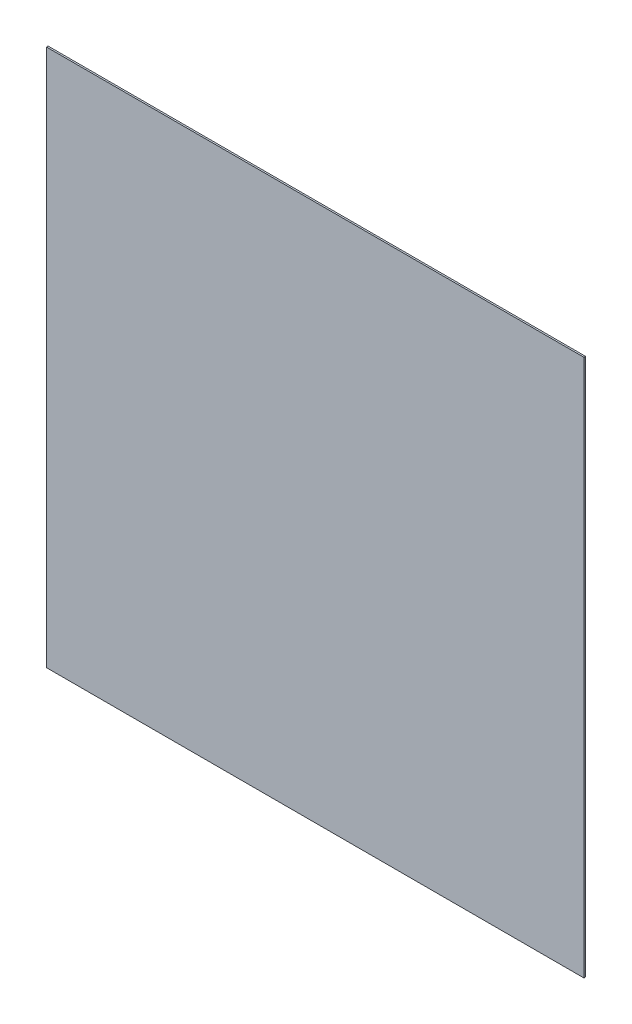
ISO-10303-21;
HEADER;
FILE_DESCRIPTION(('STEP AP214'),'2;1');
FILE_NAME('part.step','',(''),(''),'','','');
FILE_SCHEMA(('AUTOMOTIVE_DESIGN { 1 0 10303 214 1 1 1 1 }'));
ENDSEC;
DATA;
#1=APPLICATION_CONTEXT('core data for automotive mechanical design processes');
#2=APPLICATION_PROTOCOL_DEFINITION('international standard','automotive_design',2000,#1);
#3=PRODUCT_CONTEXT('',#1,'mechanical');
#4=PRODUCT('Part','Part','',(#3));
#5=PRODUCT_RELATED_PRODUCT_CATEGORY('part','',(#4));
#6=PRODUCT_DEFINITION_FORMATION('','',#4);
#7=PRODUCT_DEFINITION_CONTEXT('part definition',#1,'design');
#8=PRODUCT_DEFINITION('design','',#6,#7);
#9=PRODUCT_DEFINITION_SHAPE('','',#8);
#10=(LENGTH_UNIT() NAMED_UNIT(*) SI_UNIT(.MILLI.,.METRE.));
#11=(NAMED_UNIT(*) PLANE_ANGLE_UNIT() SI_UNIT($,.RADIAN.));
#12=(NAMED_UNIT(*) SI_UNIT($,.STERADIAN.) SOLID_ANGLE_UNIT());
#13=UNCERTAINTY_MEASURE_WITH_UNIT(LENGTH_MEASURE(1.E-05),#10,'distance_accuracy_value','');
#14=(GEOMETRIC_REPRESENTATION_CONTEXT(3) GLOBAL_UNCERTAINTY_ASSIGNED_CONTEXT((#13)) GLOBAL_UNIT_ASSIGNED_CONTEXT((#10,
#11,#12)) REPRESENTATION_CONTEXT('',''));
#15=CARTESIAN_POINT('',(0.,0.,0.));
#16=DIRECTION('',(0.,0.,1.));
#17=DIRECTION('',(1.,0.,0.));
#18=AXIS2_PLACEMENT_3D('',#15,#16,#17);
#19=CARTESIAN_POINT('',(0.221931906506307,27.2117550842403,13.76934));
#20=DIRECTION('',(0.,-1.,0.));
#21=DIRECTION('',(0.,0.,-1.));
#22=AXIS2_PLACEMENT_3D('',#19,#20,#21);
#23=PLANE('',#22);
#24=DIRECTION('',(-1.,0.,0.));
#25=VECTOR('',#24,1.);
#26=CARTESIAN_POINT('',(5.17493190650631,27.2117550842403,13.7414));
#27=LINE('',#26,#25);
#28=CARTESIAN_POINT('',(9.30243190650632,27.2117550842403,13.7414));
#29=VERTEX_POINT('',#28);
#30=CARTESIAN_POINT('',(1.04743190650631,27.2117550842403,13.7414));
#31=VERTEX_POINT('',#30);
#32=EDGE_CURVE('E77',#29,#31,#27,.T.);
#33=ORIENTED_EDGE('',*,*,#32,.F.);
#34=DIRECTION('',(0.,0.,-1.));
#35=VECTOR('',#34,1.);
#36=CARTESIAN_POINT('',(9.30243190650632,27.2117550842403,13.7541));
#37=LINE('',#36,#35);
#38=CARTESIAN_POINT('',(9.30243190650632,27.2117550842403,13.7668));
#39=VERTEX_POINT('',#38);
#40=EDGE_CURVE('E69',#39,#29,#37,.T.);
#41=ORIENTED_EDGE('',*,*,#40,.F.);
#42=DIRECTION('',(1.,0.,0.));
#43=VECTOR('',#42,1.);
#44=CARTESIAN_POINT('',(5.17493190650631,27.2117550842403,13.7668));
#45=LINE('',#44,#43);
#46=CARTESIAN_POINT('',(1.04743190650631,27.2117550842403,13.7668));
#47=VERTEX_POINT('',#46);
#48=EDGE_CURVE('E68',#47,#39,#45,.T.);
#49=ORIENTED_EDGE('',*,*,#48,.F.);
#50=DIRECTION('',(0.,0.,-1.));
#51=VECTOR('',#50,1.);
#52=CARTESIAN_POINT('',(1.04743190650631,27.2117550842403,13.7541));
#53=LINE('',#52,#51);
#54=EDGE_CURVE('E34',#47,#31,#53,.T.);
#55=ORIENTED_EDGE('',*,*,#54,.T.);
#56=EDGE_LOOP('',(#33,#41,#49,#55));
#57=FACE_BOUND('',#56,.T.);
#58=ADVANCED_FACE('F17',(#57),#23,.T.);
#59=CARTESIAN_POINT('',(0.221931906506307,35.4667550842403,13.73886));
#60=DIRECTION('',(0.,1.,0.));
#61=DIRECTION('',(0.,0.,1.));
#62=AXIS2_PLACEMENT_3D('',#59,#60,#61);
#63=PLANE('',#62);
#64=DIRECTION('',(1.,0.,0.));
#65=VECTOR('',#64,1.);
#66=CARTESIAN_POINT('',(5.17493190650631,35.4667550842403,13.7414));
#67=LINE('',#66,#65);
#68=CARTESIAN_POINT('',(1.04743190650631,35.4667550842403,13.7414));
#69=VERTEX_POINT('',#68);
#70=CARTESIAN_POINT('',(9.30243190650632,35.4667550842403,13.7414));
#71=VERTEX_POINT('',#70);
#72=EDGE_CURVE('E85',#69,#71,#67,.T.);
#73=ORIENTED_EDGE('',*,*,#72,.F.);
#74=DIRECTION('',(0.,0.,1.));
#75=VECTOR('',#74,1.);
#76=CARTESIAN_POINT('',(1.04743190650631,35.4667550842403,13.7541));
#77=LINE('',#76,#75);
#78=CARTESIAN_POINT('',(1.04743190650631,35.4667550842403,13.7668));
#79=VERTEX_POINT('',#78);
#80=EDGE_CURVE('E74',#69,#79,#77,.T.);
#81=ORIENTED_EDGE('',*,*,#80,.T.);
#82=DIRECTION('',(-1.,0.,0.));
#83=VECTOR('',#82,1.);
#84=CARTESIAN_POINT('',(5.17493190650631,35.4667550842403,13.7668));
#85=LINE('',#84,#83);
#86=CARTESIAN_POINT('',(9.30243190650632,35.4667550842403,13.7668));
#87=VERTEX_POINT('',#86);
#88=EDGE_CURVE('E72',#87,#79,#85,.T.);
#89=ORIENTED_EDGE('',*,*,#88,.F.);
#90=DIRECTION('',(0.,0.,1.));
#91=VECTOR('',#90,1.);
#92=CARTESIAN_POINT('',(9.30243190650632,35.4667550842403,13.7541));
#93=LINE('',#92,#91);
#94=EDGE_CURVE('E51',#71,#87,#93,.T.);
#95=ORIENTED_EDGE('',*,*,#94,.F.);
#96=EDGE_LOOP('',(#73,#81,#89,#95));
#97=FACE_BOUND('',#96,.T.);
#98=ADVANCED_FACE('F73',(#97),#63,.T.);
#99=CARTESIAN_POINT('',(9.30243190650632,26.3862550842403,13.76934));
#100=DIRECTION('',(1.,0.,0.));
#101=DIRECTION('',(0.,0.,-1.));
#102=AXIS2_PLACEMENT_3D('',#99,#100,#101);
#103=PLANE('',#102);
#104=DIRECTION('',(0.,-1.,0.));
#105=VECTOR('',#104,1.);
#106=CARTESIAN_POINT('',(9.30243190650632,31.3392550842403,13.7414));
#107=LINE('',#106,#105);
#108=EDGE_CURVE('E66',#71,#29,#107,.T.);
#109=ORIENTED_EDGE('',*,*,#108,.F.);
#110=ORIENTED_EDGE('',*,*,#94,.T.);
#111=DIRECTION('',(0.,1.,0.));
#112=VECTOR('',#111,1.);
#113=CARTESIAN_POINT('',(9.30243190650632,31.3392550842403,13.7668));
#114=LINE('',#113,#112);
#115=EDGE_CURVE('E63',#39,#87,#114,.T.);
#116=ORIENTED_EDGE('',*,*,#115,.F.);
#117=ORIENTED_EDGE('',*,*,#40,.T.);
#118=EDGE_LOOP('',(#109,#110,#116,#117));
#119=FACE_BOUND('',#118,.T.);
#120=ADVANCED_FACE('F60',(#119),#103,.T.);
#121=CARTESIAN_POINT('',(10.1279319065063,36.2922550842403,13.7668));
#122=DIRECTION('',(0.,0.,1.));
#123=DIRECTION('',(-1.,0.,0.));
#124=AXIS2_PLACEMENT_3D('',#121,#122,#123);
#125=PLANE('',#124);
#126=ORIENTED_EDGE('',*,*,#115,.T.);
#127=ORIENTED_EDGE('',*,*,#88,.T.);
#128=DIRECTION('',(0.,1.,0.));
#129=VECTOR('',#128,1.);
#130=CARTESIAN_POINT('',(1.04743190650631,31.3392550842403,13.7668));
#131=LINE('',#130,#129);
#132=EDGE_CURVE('E21',#47,#79,#131,.T.);
#133=ORIENTED_EDGE('',*,*,#132,.F.);
#134=ORIENTED_EDGE('',*,*,#48,.T.);
#135=EDGE_LOOP('',(#126,#127,#133,#134));
#136=FACE_BOUND('',#135,.T.);
#137=ADVANCED_FACE('F79',(#136),#125,.T.);
#138=CARTESIAN_POINT('',(10.1279319065063,26.3862550842403,13.7414));
#139=DIRECTION('',(0.,0.,-1.));
#140=DIRECTION('',(-1.,0.,0.));
#141=AXIS2_PLACEMENT_3D('',#138,#139,#140);
#142=PLANE('',#141);
#143=ORIENTED_EDGE('',*,*,#72,.T.);
#144=ORIENTED_EDGE('',*,*,#108,.T.);
#145=ORIENTED_EDGE('',*,*,#32,.T.);
#146=DIRECTION('',(0.,-1.,0.));
#147=VECTOR('',#146,1.);
#148=CARTESIAN_POINT('',(1.04743190650631,31.3392550842403,13.7414));
#149=LINE('',#148,#147);
#150=EDGE_CURVE('E11',#69,#31,#149,.T.);
#151=ORIENTED_EDGE('',*,*,#150,.F.);
#152=EDGE_LOOP('',(#143,#144,#145,#151));
#153=FACE_BOUND('',#152,.T.);
#154=ADVANCED_FACE('F89',(#153),#142,.T.);
#155=CARTESIAN_POINT('',(1.04743190650631,26.3862550842403,13.73886));
#156=DIRECTION('',(-1.,0.,0.));
#157=DIRECTION('',(0.,0.,1.));
#158=AXIS2_PLACEMENT_3D('',#155,#156,#157);
#159=PLANE('',#158);
#160=ORIENTED_EDGE('',*,*,#150,.T.);
#161=ORIENTED_EDGE('',*,*,#54,.F.);
#162=ORIENTED_EDGE('',*,*,#132,.T.);
#163=ORIENTED_EDGE('',*,*,#80,.F.);
#164=EDGE_LOOP('',(#160,#161,#162,#163));
#165=FACE_BOUND('',#164,.T.);
#166=ADVANCED_FACE('F19',(#165),#159,.T.);
#167=CLOSED_SHELL('',(#58,#98,#120,#137,#154,#166));
#168=MANIFOLD_SOLID_BREP('B1',#167);
#169=ADVANCED_BREP_SHAPE_REPRESENTATION('',(#18,#168),#14);
#170=SHAPE_DEFINITION_REPRESENTATION(#9,#169);
ENDSEC;
END-ISO-10303-21;
